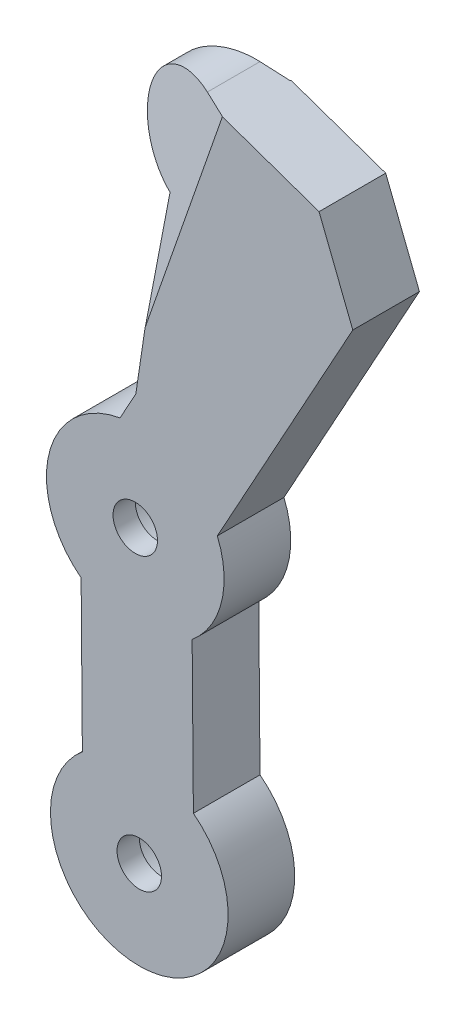
ISO-10303-21;
HEADER;
FILE_DESCRIPTION(('STEP AP214'),'2;1');
FILE_NAME('part.step','',(''),(''),'','','');
FILE_SCHEMA(('AUTOMOTIVE_DESIGN { 1 0 10303 214 1 1 1 1 }'));
ENDSEC;
DATA;
#1=APPLICATION_CONTEXT('core data for automotive mechanical design processes');
#2=APPLICATION_PROTOCOL_DEFINITION('international standard','automotive_design',2000,#1);
#3=PRODUCT_CONTEXT('',#1,'mechanical');
#4=PRODUCT('Part','Part','',(#3));
#5=PRODUCT_RELATED_PRODUCT_CATEGORY('part','',(#4));
#6=PRODUCT_DEFINITION_FORMATION('','',#4);
#7=PRODUCT_DEFINITION_CONTEXT('part definition',#1,'design');
#8=PRODUCT_DEFINITION('design','',#6,#7);
#9=PRODUCT_DEFINITION_SHAPE('','',#8);
#10=(LENGTH_UNIT() NAMED_UNIT(*) SI_UNIT(.MILLI.,.METRE.));
#11=(NAMED_UNIT(*) PLANE_ANGLE_UNIT() SI_UNIT($,.RADIAN.));
#12=(NAMED_UNIT(*) SI_UNIT($,.STERADIAN.) SOLID_ANGLE_UNIT());
#13=UNCERTAINTY_MEASURE_WITH_UNIT(LENGTH_MEASURE(1.E-05),#10,'distance_accuracy_value','');
#14=(GEOMETRIC_REPRESENTATION_CONTEXT(3) GLOBAL_UNCERTAINTY_ASSIGNED_CONTEXT((#13)) GLOBAL_UNIT_ASSIGNED_CONTEXT((#10,
#11,#12)) REPRESENTATION_CONTEXT('',''));
#15=CARTESIAN_POINT('',(0.,0.,0.));
#16=DIRECTION('',(0.,0.,1.));
#17=DIRECTION('',(1.,0.,0.));
#18=AXIS2_PLACEMENT_3D('',#15,#16,#17);
#19=CARTESIAN_POINT('',(40.5387405240072,99.7887515998659,15.));
#20=DIRECTION('',(-0.329855903742735,-0.944031293319275,0.));
#21=DIRECTION('',(0.944031293319275,-0.329855903742735,0.));
#22=AXIS2_PLACEMENT_3D('',#19,#20,#21);
#23=PLANE('',#22);
#24=DIRECTION('',(0.909794514596686,-0.317893160911327,0.26686678222586));
#25=VECTOR('',#24,1.);
#26=CARTESIAN_POINT('',(1.4985019433755,113.42988115826,9.90270766438961));
#27=LINE('',#26,#25);
#28=CARTESIAN_POINT('',(13.9405368470513,109.082484311784,13.5522854160841));
#29=VERTEX_POINT('',#28);
#30=CARTESIAN_POINT('',(18.7796984945253,107.39162294958,14.9717394541256));
#31=VERTEX_POINT('',#30);
#32=EDGE_CURVE('E178',#29,#31,#27,.T.);
#33=ORIENTED_EDGE('',*,*,#32,.T.);
#34=DIRECTION('',(-0.251930593568632,0.0880275836300266,0.963733428155533));
#35=VECTOR('',#34,1.);
#36=CARTESIAN_POINT('',(18.7796984945253,107.39162294958,14.9717394541256));
#37=LINE('',#36,#35);
#38=CARTESIAN_POINT('',(18.7723108747866,107.394204272893,15.));
#39=VERTEX_POINT('',#38);
#40=EDGE_CURVE('E183',#31,#39,#37,.T.);
#41=ORIENTED_EDGE('',*,*,#40,.T.);
#42=DIRECTION('',(-0.944031293319275,0.329855903742735,0.));
#43=VECTOR('',#42,1.);
#44=CARTESIAN_POINT('',(40.5387405240072,99.7887515998659,15.));
#45=LINE('',#44,#43);
#46=CARTESIAN_POINT('',(40.5387405240072,99.7887515998659,15.));
#47=VERTEX_POINT('',#46);
#48=EDGE_CURVE('E239',#47,#39,#45,.T.);
#49=ORIENTED_EDGE('',*,*,#48,.F.);
#50=DIRECTION('',(0.,0.,-1.));
#51=VECTOR('',#50,1.);
#52=CARTESIAN_POINT('',(40.5387405240072,99.7887515998659,15.));
#53=LINE('',#52,#51);
#54=CARTESIAN_POINT('',(40.5387405240072,99.7887515998659,0.));
#55=VERTEX_POINT('',#54);
#56=EDGE_CURVE('E307',#47,#55,#53,.T.);
#57=ORIENTED_EDGE('',*,*,#56,.T.);
#58=DIRECTION('',(-0.944031293319275,0.329855903742735,0.));
#59=VECTOR('',#58,1.);
#60=CARTESIAN_POINT('',(40.5387405240072,99.7887515998659,0.));
#61=LINE('',#60,#59);
#62=CARTESIAN_POINT('',(19.2282017215764,107.234910520302,0.));
#63=VERTEX_POINT('',#62);
#64=EDGE_CURVE('E261',#55,#63,#61,.T.);
#65=ORIENTED_EDGE('',*,*,#64,.T.);
#66=DIRECTION('',(0.249047617057943,-0.0870202369147936,0.964573876281674));
#67=VECTOR('',#66,1.);
#68=CARTESIAN_POINT('',(16.7779917016719,108.091043411441,-9.48978594745467));
#69=LINE('',#68,#67);
#70=CARTESIAN_POINT('',(19.2684678722513,107.220841042293,0.15595281536207));
#71=VERTEX_POINT('',#70);
#72=EDGE_CURVE('E86',#63,#71,#69,.T.);
#73=ORIENTED_EDGE('',*,*,#72,.T.);
#74=DIRECTION('',(-0.910587923928175,0.318170387687524,0.26381288292073));
#75=VECTOR('',#74,1.);
#76=CARTESIAN_POINT('',(19.2684678722513,107.220841042293,0.15595281536207));
#77=LINE('',#76,#75);
#78=CARTESIAN_POINT('',(13.9405368470513,109.082484311784,1.69954548425813));
#79=VERTEX_POINT('',#78);
#80=EDGE_CURVE('E198',#71,#79,#77,.T.);
#81=ORIENTED_EDGE('',*,*,#80,.T.);
#82=DIRECTION('',(0.,0.,-1.));
#83=VECTOR('',#82,1.);
#84=CARTESIAN_POINT('',(13.9405368470313,109.082484311791,15.));
#85=LINE('',#84,#83);
#86=EDGE_CURVE('E190',#29,#79,#85,.T.);
#87=ORIENTED_EDGE('',*,*,#86,.F.);
#88=EDGE_LOOP('',(#33,#41,#49,#57,#65,#73,#81,#87));
#89=FACE_BOUND('',#88,.T.);
#90=ADVANCED_FACE('F63',(#89),#23,.F.);
#91=CARTESIAN_POINT('',(9.84138893483781,97.1588665920305,15.));
#92=DIRECTION('',(0.,0.,-1.));
#93=DIRECTION('',(-1.,0.,0.));
#94=AXIS2_PLACEMENT_3D('',#91,#92,#93);
#95=CYLINDRICAL_SURFACE('',#94,12.6085555529975);
#96=CARTESIAN_POINT('',(9.84138893483781,97.1588665920305,13.5698281191331));
#97=DIRECTION('',(-0.251930593568632,0.0880275836300267,0.963733428155533));
#98=DIRECTION('',(-0.909794514596687,0.317893160911327,-0.26686678222586));
#99=AXIS2_PLACEMENT_3D('',#96,#97,#98);
#100=ELLIPSE('',#99,13.0830322832412,12.6085555529975);
#101=CARTESIAN_POINT('',(5.30776865440435,85.3935803530193,13.4593329066422));
#102=VERTEX_POINT('',#101);
#103=EDGE_CURVE('E196',#29,#102,#100,.T.);
#104=ORIENTED_EDGE('',*,*,#103,.F.);
#105=ORIENTED_EDGE('',*,*,#86,.T.);
#106=CARTESIAN_POINT('',(9.84138893483781,97.1588665920305,1.68221864205295));
#107=DIRECTION('',(-0.249047617057943,0.0870202369147936,-0.964573876281674));
#108=DIRECTION('',(0.910587923928175,-0.318170387687524,-0.26381288292073));
#109=AXIS2_PLACEMENT_3D('',#106,#107,#108);
#110=ELLIPSE('',#109,13.0716328350112,12.6085555529975);
#111=CARTESIAN_POINT('',(5.30776865440435,85.3935803530193,1.79135422428974));
#112=VERTEX_POINT('',#111);
#113=EDGE_CURVE('E208',#112,#79,#110,.T.);
#114=ORIENTED_EDGE('',*,*,#113,.F.);
#115=DIRECTION('',(0.,0.,-1.));
#116=VECTOR('',#115,1.);
#117=CARTESIAN_POINT('',(5.30776865440435,85.3935803530193,15.));
#118=LINE('',#117,#116);
#119=EDGE_CURVE('E304',#102,#112,#118,.T.);
#120=ORIENTED_EDGE('',*,*,#119,.F.);
#121=EDGE_LOOP('',(#104,#105,#114,#120));
#122=FACE_BOUND('',#121,.T.);
#123=ADVANCED_FACE('F377',(#122),#95,.T.);
#124=CARTESIAN_POINT('',(5.50581694547402,85.3260122167898,15.));
#125=DIRECTION('',(0.322895145350239,0.946434744242437,0.));
#126=DIRECTION('',(-0.946434744242438,0.322895145350239,0.));
#127=AXIS2_PLACEMENT_3D('',#124,#125,#126);
#128=PLANE('',#127);
#129=DIRECTION('',(0.912112561886724,-0.311185446263318,0.266860061609707));
#130=VECTOR('',#129,1.);
#131=CARTESIAN_POINT('',(5.866721329619,85.2028824666565,13.6228677065973));
#132=LINE('',#131,#130);
#133=CARTESIAN_POINT('',(5.50581694547402,85.3260122167898,13.5172766093879));
#134=VERTEX_POINT('',#133);
#135=EDGE_CURVE('E194',#102,#134,#132,.T.);
#136=ORIENTED_EDGE('',*,*,#135,.F.);
#137=ORIENTED_EDGE('',*,*,#119,.T.);
#138=DIRECTION('',(-0.912907952614777,0.311456809721081,0.263806227619939));
#139=VECTOR('',#138,1.);
#140=CARTESIAN_POINT('',(2.3109852564209,86.4159929564889,2.65734528171421));
#141=LINE('',#140,#139);
#142=CARTESIAN_POINT('',(5.50581694547402,85.3260122167898,1.73412351181318));
#143=VERTEX_POINT('',#142);
#144=EDGE_CURVE('E205',#143,#112,#141,.T.);
#145=ORIENTED_EDGE('',*,*,#144,.F.);
#146=DIRECTION('',(0.,0.,-1.));
#147=VECTOR('',#146,1.);
#148=CARTESIAN_POINT('',(5.50581694547402,85.3260122167898,15.));
#149=LINE('',#148,#147);
#150=EDGE_CURVE('E302',#134,#143,#149,.T.);
#151=ORIENTED_EDGE('',*,*,#150,.F.);
#152=EDGE_LOOP('',(#136,#137,#145,#151));
#153=FACE_BOUND('',#152,.T.);
#154=ADVANCED_FACE('F374',(#153),#128,.F.);
#155=CARTESIAN_POINT('',(5.50581694547402,85.3260122167898,15.));
#156=DIRECTION('',(0.989057231211688,-0.147532346920497,0.));
#157=DIRECTION('',(0.147532346920497,0.989057231211688,0.));
#158=AXIS2_PLACEMENT_3D('',#155,#156,#157);
#159=PLANE('',#158);
#160=DIRECTION('',(-0.147335009292332,-0.987734279247586,0.0517048221743451));
#161=VECTOR('',#160,1.);
#162=CARTESIAN_POINT('',(5.49452166179957,85.2502886061376,13.5212405052508));
#163=LINE('',#162,#161);
#164=CARTESIAN_POINT('',(1.36126547555131,57.5409285587288,14.9717394541256));
#165=VERTEX_POINT('',#164);
#166=EDGE_CURVE('E12',#134,#165,#163,.T.);
#167=ORIENTED_EDGE('',*,*,#166,.F.);
#168=ORIENTED_EDGE('',*,*,#150,.T.);
#169=DIRECTION('',(0.147339826401463,0.987766573159521,0.0510702702624874));
#170=VECTOR('',#169,1.);
#171=CARTESIAN_POINT('',(5.60563848404308,85.9952160667469,1.76872320612019));
#172=LINE('',#171,#170);
#173=CARTESIAN_POINT('',(0.952729694283552,54.8021036358845,0.155952815362067));
#174=VERTEX_POINT('',#173);
#175=EDGE_CURVE('E312',#174,#143,#172,.T.);
#176=ORIENTED_EDGE('',*,*,#175,.F.);
#177=DIRECTION('',(-0.121793071676651,-0.81650106412385,0.564351362163844));
#178=VECTOR('',#177,1.);
#179=CARTESIAN_POINT('',(3.0354009720215,68.7643372102858,-9.49450066569776));
#180=LINE('',#179,#178);
#181=CARTESIAN_POINT('',(0.986385983065761,55.0277354819887,0.));
#182=VERTEX_POINT('',#181);
#183=EDGE_CURVE('E203',#182,#174,#180,.T.);
#184=ORIENTED_EDGE('',*,*,#183,.F.);
#185=DIRECTION('',(-0.147532346920497,-0.989057231211688,0.));
#186=VECTOR('',#185,1.);
#187=CARTESIAN_POINT('',(5.50581694547402,85.3260122167898,0.));
#188=LINE('',#187,#186);
#189=CARTESIAN_POINT('',(-0.715580359542123,43.6177487667205,0.));
#190=VERTEX_POINT('',#189);
#191=EDGE_CURVE('E264',#182,#190,#188,.T.);
#192=ORIENTED_EDGE('',*,*,#191,.T.);
#193=DIRECTION('',(0.,0.,-1.));
#194=VECTOR('',#193,1.);
#195=CARTESIAN_POINT('',(-0.715580359542123,43.6177487667205,15.));
#196=LINE('',#195,#194);
#197=CARTESIAN_POINT('',(-0.715580359542123,43.6177487667205,15.));
#198=VERTEX_POINT('',#197);
#199=EDGE_CURVE('E299',#198,#190,#196,.T.);
#200=ORIENTED_EDGE('',*,*,#199,.F.);
#201=DIRECTION('',(-0.147532346920497,-0.989057231211688,0.));
#202=VECTOR('',#201,1.);
#203=CARTESIAN_POINT('',(5.50581694547402,85.3260122167898,15.));
#204=LINE('',#203,#202);
#205=CARTESIAN_POINT('',(1.36744038572204,57.5823251723118,15.));
#206=VERTEX_POINT('',#205);
#207=EDGE_CURVE('E242',#206,#198,#204,.T.);
#208=ORIENTED_EDGE('',*,*,#207,.F.);
#209=DIRECTION('',(0.122270233047621,0.819699955175634,0.55959089842093));
#210=VECTOR('',#209,1.);
#211=CARTESIAN_POINT('',(4.20991754207175,76.6382993008648,28.0090890155022));
#212=LINE('',#211,#210);
#213=EDGE_CURVE('E78',#165,#206,#212,.T.);
#214=ORIENTED_EDGE('',*,*,#213,.F.);
#215=EDGE_LOOP('',(#167,#168,#176,#184,#192,#200,#208,#214));
#216=FACE_BOUND('',#215,.T.);
#217=ADVANCED_FACE('F319',(#216),#159,.F.);
#218=CARTESIAN_POINT('',(-0.839707243672549,17.4582706729418,15.));
#219=DIRECTION('',(0.,0.,1.));
#220=DIRECTION('',(1.,0.,0.));
#221=AXIS2_PLACEMENT_3D('',#218,#219,#220);
#222=PLANE('',#221);
#223=CARTESIAN_POINT('',(-0.839707243672549,17.4582706729418,15.));
#224=DIRECTION('',(0.,0.,1.));
#225=DIRECTION('',(1.,0.,0.));
#226=AXIS2_PLACEMENT_3D('',#223,#224,#225);
#227=CIRCLE('',#226,5.);
#228=CARTESIAN_POINT('',(4.16029275632745,17.4582706729418,15.));
#229=VERTEX_POINT('',#228);
#230=EDGE_CURVE('E220',#229,#229,#227,.T.);
#231=ORIENTED_EDGE('',*,*,#230,.F.);
#232=EDGE_LOOP('',(#231));
#233=FACE_BOUND('',#232,.T.);
#234=CARTESIAN_POINT('',(0.0627733290771948,-47.5417293270582,15.));
#235=DIRECTION('',(0.,0.,1.));
#236=DIRECTION('',(1.,0.,0.));
#237=AXIS2_PLACEMENT_3D('',#234,#235,#236);
#238=CIRCLE('',#237,5.);
#239=CARTESIAN_POINT('',(5.06277332907719,-47.5417293270582,15.));
#240=VERTEX_POINT('',#239);
#241=EDGE_CURVE('E214',#240,#240,#238,.T.);
#242=ORIENTED_EDGE('',*,*,#241,.F.);
#243=EDGE_LOOP('',(#242));
#244=FACE_BOUND('',#243,.T.);
#245=ORIENTED_EDGE('',*,*,#48,.T.);
#246=DIRECTION('',(-0.329855903742735,-0.944031293319275,0.));
#247=VECTOR('',#246,1.);
#248=CARTESIAN_POINT('',(-11.3671098096123,21.1366719208941,15.));
#249=LINE('',#248,#247);
#250=EDGE_CURVE('E71',#39,#206,#249,.T.);
#251=ORIENTED_EDGE('',*,*,#250,.T.);
#252=ORIENTED_EDGE('',*,*,#207,.T.);
#253=DIRECTION('',(-0.48233631116927,-0.87598612028252,0.));
#254=VECTOR('',#253,1.);
#255=CARTESIAN_POINT('',(-4.27033710901568,37.1618434131079,15.));
#256=LINE('',#255,#254);
#257=CARTESIAN_POINT('',(-4.27033710901568,37.1618434131079,15.));
#258=VERTEX_POINT('',#257);
#259=EDGE_CURVE('E244',#198,#258,#256,.T.);
#260=ORIENTED_EDGE('',*,*,#259,.T.);
#261=CARTESIAN_POINT('',(-0.839707243672549,17.4582706729418,15.));
#262=DIRECTION('',(0.,0.,1.));
#263=DIRECTION('',(1.,0.,0.));
#264=AXIS2_PLACEMENT_3D('',#261,#262,#263);
#265=CIRCLE('',#264,20.);
#266=CARTESIAN_POINT('',(-13.0309125696976,1.60347604485851,15.));
#267=VERTEX_POINT('',#266);
#268=EDGE_CURVE('E246',#258,#267,#265,.T.);
#269=ORIENTED_EDGE('',*,*,#268,.T.);
#270=DIRECTION('',(0.00827665513011626,-0.999965747903325,0.));
#271=VECTOR('',#270,1.);
#272=CARTESIAN_POINT('',(-13.0309125696976,1.60347604485851,15.));
#273=LINE('',#272,#271);
#274=CARTESIAN_POINT('',(-12.7512398622865,-32.1859139487867,15.));
#275=VERTEX_POINT('',#274);
#276=EDGE_CURVE('E248',#267,#275,#273,.T.);
#277=ORIENTED_EDGE('',*,*,#276,.T.);
#278=CARTESIAN_POINT('',(0.0627733290771949,-47.5417293270582,15.));
#279=DIRECTION('',(0.,0.,1.));
#280=DIRECTION('',(1.,0.,0.));
#281=AXIS2_PLACEMENT_3D('',#278,#279,#280);
#282=CIRCLE('',#281,20.0000000000001);
#283=CARTESIAN_POINT('',(12.2436198655101,-31.6789749112619,15.));
#284=VERTEX_POINT('',#283);
#285=EDGE_CURVE('E250',#275,#284,#282,.T.);
#286=ORIENTED_EDGE('',*,*,#285,.T.);
#287=DIRECTION('',(-0.00827085395216305,0.999965795902491,0.));
#288=VECTOR('',#287,1.);
#289=CARTESIAN_POINT('',(11.9642781989979,2.09409296035713,15.));
#290=LINE('',#289,#288);
#291=CARTESIAN_POINT('',(11.9642781989979,2.09409296035712,15.));
#292=VERTEX_POINT('',#291);
#293=EDGE_CURVE('E252',#284,#292,#290,.T.);
#294=ORIENTED_EDGE('',*,*,#293,.T.);
#295=CARTESIAN_POINT('',(-0.839707243672549,17.4582706729418,15.));
#296=DIRECTION('',(0.,0.,1.));
#297=DIRECTION('',(1.,0.,0.));
#298=AXIS2_PLACEMENT_3D('',#295,#296,#297);
#299=CIRCLE('',#298,20.);
#300=CARTESIAN_POINT('',(17.6362151559132,25.1159655927259,15.));
#301=VERTEX_POINT('',#300);
#302=EDGE_CURVE('E254',#292,#301,#299,.T.);
#303=ORIENTED_EDGE('',*,*,#302,.T.);
#304=DIRECTION('',(0.482336311169269,0.87598612028252,0.));
#305=VECTOR('',#304,1.);
#306=CARTESIAN_POINT('',(17.6362151559132,25.1159655927259,15.));
#307=LINE('',#306,#305);
#308=CARTESIAN_POINT('',(48.1292087035366,80.4952486677015,15.));
#309=VERTEX_POINT('',#308);
#310=EDGE_CURVE('E256',#301,#309,#307,.T.);
#311=ORIENTED_EDGE('',*,*,#310,.T.);
#312=DIRECTION('',(-0.36610684099222,0.930572824113566,0.));
#313=VECTOR('',#312,1.);
#314=CARTESIAN_POINT('',(40.5387405240072,99.7887515998659,15.));
#315=LINE('',#314,#313);
#316=EDGE_CURVE('E236',#309,#47,#315,.T.);
#317=ORIENTED_EDGE('',*,*,#316,.T.);
#318=EDGE_LOOP('',(#245,#251,#252,#260,#269,#277,#286,#294,#303,#311,#317));
#319=FACE_BOUND('',#318,.T.);
#320=ADVANCED_FACE('F316',(#233,#244,#319),#222,.T.);
#321=CARTESIAN_POINT('',(-0.839707243672549,17.4582706729418,0.));
#322=DIRECTION('',(0.,0.,1.));
#323=DIRECTION('',(1.,0.,0.));
#324=AXIS2_PLACEMENT_3D('',#321,#322,#323);
#325=PLANE('',#324);
#326=CARTESIAN_POINT('',(-0.839707243672549,17.4582706729418,0.));
#327=DIRECTION('',(0.,0.,-1.));
#328=DIRECTION('',(-1.,0.,0.));
#329=AXIS2_PLACEMENT_3D('',#326,#327,#328);
#330=CIRCLE('',#329,11.1);
#331=CARTESIAN_POINT('',(-11.9397072436725,17.4582706729418,0.));
#332=VERTEX_POINT('',#331);
#333=EDGE_CURVE('E227',#332,#332,#330,.T.);
#334=ORIENTED_EDGE('',*,*,#333,.F.);
#335=EDGE_LOOP('',(#334));
#336=FACE_BOUND('',#335,.T.);
#337=CARTESIAN_POINT('',(0.0627733290771949,-47.5417293270582,0.));
#338=DIRECTION('',(0.,0.,-1.));
#339=DIRECTION('',(-1.,0.,0.));
#340=AXIS2_PLACEMENT_3D('',#337,#338,#339);
#341=CIRCLE('',#340,11.1);
#342=CARTESIAN_POINT('',(-11.0372266709228,-47.5417293270582,0.));
#343=VERTEX_POINT('',#342);
#344=EDGE_CURVE('E223',#343,#343,#341,.T.);
#345=ORIENTED_EDGE('',*,*,#344,.F.);
#346=EDGE_LOOP('',(#345));
#347=FACE_BOUND('',#346,.T.);
#348=DIRECTION('',(-0.329855903742735,-0.944031293319275,0.));
#349=VECTOR('',#348,1.);
#350=CARTESIAN_POINT('',(-10.9112189628225,20.9773781683034,0.));
#351=LINE('',#350,#349);
#352=EDGE_CURVE('E310',#63,#182,#351,.T.);
#353=ORIENTED_EDGE('',*,*,#352,.F.);
#354=ORIENTED_EDGE('',*,*,#64,.F.);
#355=DIRECTION('',(-0.36610684099222,0.930572824113566,0.));
#356=VECTOR('',#355,1.);
#357=CARTESIAN_POINT('',(40.5387405240072,99.7887515998659,0.));
#358=LINE('',#357,#356);
#359=CARTESIAN_POINT('',(48.1292087035366,80.4952486677015,0.));
#360=VERTEX_POINT('',#359);
#361=EDGE_CURVE('E233',#360,#55,#358,.T.);
#362=ORIENTED_EDGE('',*,*,#361,.F.);
#363=DIRECTION('',(0.482336311169269,0.87598612028252,0.));
#364=VECTOR('',#363,1.);
#365=CARTESIAN_POINT('',(17.6362151559132,25.1159655927259,0.));
#366=LINE('',#365,#364);
#367=CARTESIAN_POINT('',(17.6362151559132,25.1159655927259,0.));
#368=VERTEX_POINT('',#367);
#369=EDGE_CURVE('E240',#368,#360,#366,.T.);
#370=ORIENTED_EDGE('',*,*,#369,.F.);
#371=CARTESIAN_POINT('',(-0.839707243672549,17.4582706729418,0.));
#372=DIRECTION('',(0.,0.,1.));
#373=DIRECTION('',(1.,0.,0.));
#374=AXIS2_PLACEMENT_3D('',#371,#372,#373);
#375=CIRCLE('',#374,20.);
#376=CARTESIAN_POINT('',(11.9642781989979,2.09409296035712,0.));
#377=VERTEX_POINT('',#376);
#378=EDGE_CURVE('E276',#377,#368,#375,.T.);
#379=ORIENTED_EDGE('',*,*,#378,.F.);
#380=DIRECTION('',(-0.00827085395216305,0.999965795902491,0.));
#381=VECTOR('',#380,1.);
#382=CARTESIAN_POINT('',(11.9642781989979,2.09409296035713,0.));
#383=LINE('',#382,#381);
#384=CARTESIAN_POINT('',(12.2436198655101,-31.6789749112619,0.));
#385=VERTEX_POINT('',#384);
#386=EDGE_CURVE('E274',#385,#377,#383,.T.);
#387=ORIENTED_EDGE('',*,*,#386,.F.);
#388=CARTESIAN_POINT('',(0.0627733290771949,-47.5417293270582,0.));
#389=DIRECTION('',(0.,0.,1.));
#390=DIRECTION('',(1.,0.,0.));
#391=AXIS2_PLACEMENT_3D('',#388,#389,#390);
#392=CIRCLE('',#391,20.0000000000001);
#393=CARTESIAN_POINT('',(-12.7512398622865,-32.1859139487867,0.));
#394=VERTEX_POINT('',#393);
#395=EDGE_CURVE('E272',#394,#385,#392,.T.);
#396=ORIENTED_EDGE('',*,*,#395,.F.);
#397=DIRECTION('',(0.00827665513011626,-0.999965747903325,0.));
#398=VECTOR('',#397,1.);
#399=CARTESIAN_POINT('',(-13.0309125696976,1.60347604485851,0.));
#400=LINE('',#399,#398);
#401=CARTESIAN_POINT('',(-13.0309125696976,1.60347604485851,0.));
#402=VERTEX_POINT('',#401);
#403=EDGE_CURVE('E270',#402,#394,#400,.T.);
#404=ORIENTED_EDGE('',*,*,#403,.F.);
#405=CARTESIAN_POINT('',(-0.839707243672549,17.4582706729418,0.));
#406=DIRECTION('',(0.,0.,1.));
#407=DIRECTION('',(1.,0.,0.));
#408=AXIS2_PLACEMENT_3D('',#405,#406,#407);
#409=CIRCLE('',#408,20.);
#410=CARTESIAN_POINT('',(-4.27033710901568,37.1618434131079,0.));
#411=VERTEX_POINT('',#410);
#412=EDGE_CURVE('E268',#411,#402,#409,.T.);
#413=ORIENTED_EDGE('',*,*,#412,.F.);
#414=DIRECTION('',(-0.48233631116927,-0.87598612028252,0.));
#415=VECTOR('',#414,1.);
#416=CARTESIAN_POINT('',(-4.27033710901568,37.1618434131079,0.));
#417=LINE('',#416,#415);
#418=EDGE_CURVE('E266',#190,#411,#417,.T.);
#419=ORIENTED_EDGE('',*,*,#418,.F.);
#420=ORIENTED_EDGE('',*,*,#191,.F.);
#421=EDGE_LOOP('',(#353,#354,#362,#370,#379,#387,#396,#404,#413,#419,#420));
#422=FACE_BOUND('',#421,.T.);
#423=ADVANCED_FACE('F362',(#336,#347,#422),#325,.F.);
#424=CARTESIAN_POINT('',(40.5387405240072,99.7887515998659,15.));
#425=DIRECTION('',(-0.930572824113566,-0.36610684099222,0.));
#426=DIRECTION('',(0.36610684099222,-0.930572824113566,0.));
#427=AXIS2_PLACEMENT_3D('',#424,#425,#426);
#428=PLANE('',#427);
#429=ORIENTED_EDGE('',*,*,#361,.T.);
#430=ORIENTED_EDGE('',*,*,#56,.F.);
#431=ORIENTED_EDGE('',*,*,#316,.F.);
#432=DIRECTION('',(0.,0.,-1.));
#433=VECTOR('',#432,1.);
#434=CARTESIAN_POINT('',(48.1292087035366,80.4952486677015,15.));
#435=LINE('',#434,#433);
#436=EDGE_CURVE('E258',#309,#360,#435,.T.);
#437=ORIENTED_EDGE('',*,*,#436,.T.);
#438=EDGE_LOOP('',(#429,#430,#431,#437));
#439=FACE_BOUND('',#438,.T.);
#440=ADVANCED_FACE('F65',(#439),#428,.F.);
#441=CARTESIAN_POINT('',(-4.27033710901568,37.1618434131079,15.));
#442=DIRECTION('',(0.87598612028252,-0.48233631116927,0.));
#443=DIRECTION('',(0.48233631116927,0.87598612028252,0.));
#444=AXIS2_PLACEMENT_3D('',#441,#442,#443);
#445=PLANE('',#444);
#446=ORIENTED_EDGE('',*,*,#418,.T.);
#447=DIRECTION('',(0.,0.,-1.));
#448=VECTOR('',#447,1.);
#449=CARTESIAN_POINT('',(-4.27033710901568,37.1618434131079,15.));
#450=LINE('',#449,#448);
#451=EDGE_CURVE('E296',#258,#411,#450,.T.);
#452=ORIENTED_EDGE('',*,*,#451,.F.);
#453=ORIENTED_EDGE('',*,*,#259,.F.);
#454=ORIENTED_EDGE('',*,*,#199,.T.);
#455=EDGE_LOOP('',(#446,#452,#453,#454));
#456=FACE_BOUND('',#455,.T.);
#457=ADVANCED_FACE('F326',(#456),#445,.F.);
#458=CARTESIAN_POINT('',(-0.839707243672549,17.4582706729418,15.));
#459=DIRECTION('',(0.,0.,-1.));
#460=DIRECTION('',(-1.,0.,0.));
#461=AXIS2_PLACEMENT_3D('',#458,#459,#460);
#462=CYLINDRICAL_SURFACE('',#461,20.);
#463=ORIENTED_EDGE('',*,*,#412,.T.);
#464=DIRECTION('',(0.,0.,-1.));
#465=VECTOR('',#464,1.);
#466=CARTESIAN_POINT('',(-13.0309125696976,1.60347604485851,15.));
#467=LINE('',#466,#465);
#468=EDGE_CURVE('E293',#267,#402,#467,.T.);
#469=ORIENTED_EDGE('',*,*,#468,.F.);
#470=ORIENTED_EDGE('',*,*,#268,.F.);
#471=ORIENTED_EDGE('',*,*,#451,.T.);
#472=EDGE_LOOP('',(#463,#469,#470,#471));
#473=FACE_BOUND('',#472,.T.);
#474=ADVANCED_FACE('F332',(#473),#462,.T.);
#475=CARTESIAN_POINT('',(-13.0309125696976,1.60347604485851,15.));
#476=DIRECTION('',(0.999965747903326,0.00827665513011626,0.));
#477=DIRECTION('',(-0.00827665513011626,0.999965747903326,0.));
#478=AXIS2_PLACEMENT_3D('',#475,#476,#477);
#479=PLANE('',#478);
#480=ORIENTED_EDGE('',*,*,#403,.T.);
#481=DIRECTION('',(0.,0.,-1.));
#482=VECTOR('',#481,1.);
#483=CARTESIAN_POINT('',(-12.7512398622865,-32.1859139487867,15.));
#484=LINE('',#483,#482);
#485=EDGE_CURVE('E290',#275,#394,#484,.T.);
#486=ORIENTED_EDGE('',*,*,#485,.F.);
#487=ORIENTED_EDGE('',*,*,#276,.F.);
#488=ORIENTED_EDGE('',*,*,#468,.T.);
#489=EDGE_LOOP('',(#480,#486,#487,#488));
#490=FACE_BOUND('',#489,.T.);
#491=ADVANCED_FACE('F336',(#490),#479,.F.);
#492=CARTESIAN_POINT('',(0.0627733290771949,-47.5417293270582,15.));
#493=DIRECTION('',(0.,0.,-1.));
#494=DIRECTION('',(-1.,0.,0.));
#495=AXIS2_PLACEMENT_3D('',#492,#493,#494);
#496=CYLINDRICAL_SURFACE('',#495,20.0000000000001);
#497=ORIENTED_EDGE('',*,*,#395,.T.);
#498=DIRECTION('',(0.,0.,-1.));
#499=VECTOR('',#498,1.);
#500=CARTESIAN_POINT('',(12.2436198655101,-31.6789749112619,15.));
#501=LINE('',#500,#499);
#502=EDGE_CURVE('E287',#284,#385,#501,.T.);
#503=ORIENTED_EDGE('',*,*,#502,.F.);
#504=ORIENTED_EDGE('',*,*,#285,.F.);
#505=ORIENTED_EDGE('',*,*,#485,.T.);
#506=EDGE_LOOP('',(#497,#503,#504,#505));
#507=FACE_BOUND('',#506,.T.);
#508=ADVANCED_FACE('F341',(#507),#496,.T.);
#509=CARTESIAN_POINT('',(11.9642781989979,2.09409296035713,15.));
#510=DIRECTION('',(-0.999965795902491,-0.00827085395216305,0.));
#511=DIRECTION('',(0.00827085395216305,-0.999965795902491,0.));
#512=AXIS2_PLACEMENT_3D('',#509,#510,#511);
#513=PLANE('',#512);
#514=ORIENTED_EDGE('',*,*,#386,.T.);
#515=DIRECTION('',(0.,0.,-1.));
#516=VECTOR('',#515,1.);
#517=CARTESIAN_POINT('',(11.9642781989979,2.09409296035712,15.));
#518=LINE('',#517,#516);
#519=EDGE_CURVE('E284',#292,#377,#518,.T.);
#520=ORIENTED_EDGE('',*,*,#519,.F.);
#521=ORIENTED_EDGE('',*,*,#293,.F.);
#522=ORIENTED_EDGE('',*,*,#502,.T.);
#523=EDGE_LOOP('',(#514,#520,#521,#522));
#524=FACE_BOUND('',#523,.T.);
#525=ADVANCED_FACE('F347',(#524),#513,.F.);
#526=CARTESIAN_POINT('',(-0.839707243672549,17.4582706729418,15.));
#527=DIRECTION('',(0.,0.,-1.));
#528=DIRECTION('',(-1.,0.,0.));
#529=AXIS2_PLACEMENT_3D('',#526,#527,#528);
#530=CYLINDRICAL_SURFACE('',#529,20.);
#531=ORIENTED_EDGE('',*,*,#378,.T.);
#532=DIRECTION('',(0.,0.,-1.));
#533=VECTOR('',#532,1.);
#534=CARTESIAN_POINT('',(17.6362151559132,25.1159655927259,15.));
#535=LINE('',#534,#533);
#536=EDGE_CURVE('E281',#301,#368,#535,.T.);
#537=ORIENTED_EDGE('',*,*,#536,.F.);
#538=ORIENTED_EDGE('',*,*,#302,.F.);
#539=ORIENTED_EDGE('',*,*,#519,.T.);
#540=EDGE_LOOP('',(#531,#537,#538,#539));
#541=FACE_BOUND('',#540,.T.);
#542=ADVANCED_FACE('F351',(#541),#530,.T.);
#543=CARTESIAN_POINT('',(17.6362151559132,25.1159655927259,15.));
#544=DIRECTION('',(-0.87598612028252,0.482336311169269,0.));
#545=DIRECTION('',(-0.482336311169269,-0.87598612028252,0.));
#546=AXIS2_PLACEMENT_3D('',#543,#544,#545);
#547=PLANE('',#546);
#548=ORIENTED_EDGE('',*,*,#369,.T.);
#549=ORIENTED_EDGE('',*,*,#436,.F.);
#550=ORIENTED_EDGE('',*,*,#310,.F.);
#551=ORIENTED_EDGE('',*,*,#536,.T.);
#552=EDGE_LOOP('',(#548,#549,#550,#551));
#553=FACE_BOUND('',#552,.T.);
#554=ADVANCED_FACE('F356',(#553),#547,.F.);
#555=CARTESIAN_POINT('',(-0.839707243672549,17.4582706729418,10.));
#556=DIRECTION('',(0.,0.,-1.));
#557=DIRECTION('',(-1.,0.,0.));
#558=AXIS2_PLACEMENT_3D('',#555,#556,#557);
#559=CYLINDRICAL_SURFACE('',#558,11.1);
#560=CARTESIAN_POINT('',(-0.839707243672549,17.4582706729418,10.));
#561=DIRECTION('',(0.,0.,-1.));
#562=DIRECTION('',(-1.,0.,0.));
#563=AXIS2_PLACEMENT_3D('',#560,#561,#562);
#564=CIRCLE('',#563,11.1);
#565=CARTESIAN_POINT('',(-11.9397072436725,17.4582706729418,10.));
#566=VERTEX_POINT('',#565);
#567=EDGE_CURVE('E230',#566,#566,#564,.T.);
#568=ORIENTED_EDGE('',*,*,#567,.F.);
#569=EDGE_LOOP('',(#568));
#570=FACE_BOUND('',#569,.T.);
#571=ORIENTED_EDGE('',*,*,#333,.T.);
#572=EDGE_LOOP('',(#571));
#573=FACE_BOUND('',#572,.T.);
#574=ADVANCED_FACE('F402',(#570,#573),#559,.F.);
#575=CARTESIAN_POINT('',(-0.839707243672549,17.4582706729418,10.));
#576=DIRECTION('',(0.,0.,-1.));
#577=DIRECTION('',(-1.,0.,0.));
#578=AXIS2_PLACEMENT_3D('',#575,#576,#577);
#579=PLANE('',#578);
#580=CARTESIAN_POINT('',(-0.839707243672549,17.4582706729418,10.));
#581=DIRECTION('',(0.,0.,-1.));
#582=DIRECTION('',(-1.,0.,0.));
#583=AXIS2_PLACEMENT_3D('',#580,#581,#582);
#584=CIRCLE('',#583,5.);
#585=CARTESIAN_POINT('',(-5.83970724367255,17.4582706729418,10.));
#586=VERTEX_POINT('',#585);
#587=EDGE_CURVE('E217',#586,#586,#584,.T.);
#588=ORIENTED_EDGE('',*,*,#587,.F.);
#589=EDGE_LOOP('',(#588));
#590=FACE_BOUND('',#589,.T.);
#591=ORIENTED_EDGE('',*,*,#567,.T.);
#592=EDGE_LOOP('',(#591));
#593=FACE_BOUND('',#592,.T.);
#594=ADVANCED_FACE('F411',(#590,#593),#579,.T.);
#595=CARTESIAN_POINT('',(0.0627733290771949,-47.5417293270582,10.));
#596=DIRECTION('',(0.,0.,-1.));
#597=DIRECTION('',(-1.,0.,0.));
#598=AXIS2_PLACEMENT_3D('',#595,#596,#597);
#599=CYLINDRICAL_SURFACE('',#598,11.1);
#600=CARTESIAN_POINT('',(0.0627733290771949,-47.5417293270582,10.));
#601=DIRECTION('',(0.,0.,-1.));
#602=DIRECTION('',(-1.,0.,0.));
#603=AXIS2_PLACEMENT_3D('',#600,#601,#602);
#604=CIRCLE('',#603,11.1);
#605=CARTESIAN_POINT('',(-11.0372266709228,-47.5417293270582,10.));
#606=VERTEX_POINT('',#605);
#607=EDGE_CURVE('E224',#606,#606,#604,.T.);
#608=ORIENTED_EDGE('',*,*,#607,.F.);
#609=EDGE_LOOP('',(#608));
#610=FACE_BOUND('',#609,.T.);
#611=ORIENTED_EDGE('',*,*,#344,.T.);
#612=EDGE_LOOP('',(#611));
#613=FACE_BOUND('',#612,.T.);
#614=ADVANCED_FACE('F415',(#610,#613),#599,.F.);
#615=CARTESIAN_POINT('',(0.0627733290771949,-47.5417293270582,10.));
#616=DIRECTION('',(0.,0.,-1.));
#617=DIRECTION('',(-1.,0.,0.));
#618=AXIS2_PLACEMENT_3D('',#615,#616,#617);
#619=PLANE('',#618);
#620=CARTESIAN_POINT('',(0.0627733290771948,-47.5417293270582,10.));
#621=DIRECTION('',(0.,0.,-1.));
#622=DIRECTION('',(-1.,0.,0.));
#623=AXIS2_PLACEMENT_3D('',#620,#621,#622);
#624=CIRCLE('',#623,5.);
#625=CARTESIAN_POINT('',(-4.93722667092281,-47.5417293270582,10.));
#626=VERTEX_POINT('',#625);
#627=EDGE_CURVE('E211',#626,#626,#624,.T.);
#628=ORIENTED_EDGE('',*,*,#627,.F.);
#629=EDGE_LOOP('',(#628));
#630=FACE_BOUND('',#629,.T.);
#631=ORIENTED_EDGE('',*,*,#607,.T.);
#632=EDGE_LOOP('',(#631));
#633=FACE_BOUND('',#632,.T.);
#634=ADVANCED_FACE('F419',(#630,#633),#619,.T.);
#635=CARTESIAN_POINT('',(-0.839707243672549,17.4582706729418,20.));
#636=DIRECTION('',(0.,0.,-1.));
#637=DIRECTION('',(-1.,0.,0.));
#638=AXIS2_PLACEMENT_3D('',#635,#636,#637);
#639=CYLINDRICAL_SURFACE('',#638,5.);
#640=ORIENTED_EDGE('',*,*,#230,.T.);
#641=EDGE_LOOP('',(#640));
#642=FACE_BOUND('',#641,.T.);
#643=ORIENTED_EDGE('',*,*,#587,.T.);
#644=EDGE_LOOP('',(#643));
#645=FACE_BOUND('',#644,.T.);
#646=ADVANCED_FACE('F423',(#642,#645),#639,.F.);
#647=CARTESIAN_POINT('',(0.0627733290771948,-47.5417293270582,20.));
#648=DIRECTION('',(0.,0.,-1.));
#649=DIRECTION('',(-1.,0.,0.));
#650=AXIS2_PLACEMENT_3D('',#647,#648,#649);
#651=CYLINDRICAL_SURFACE('',#650,5.);
#652=ORIENTED_EDGE('',*,*,#241,.T.);
#653=EDGE_LOOP('',(#652));
#654=FACE_BOUND('',#653,.T.);
#655=ORIENTED_EDGE('',*,*,#627,.T.);
#656=EDGE_LOOP('',(#655));
#657=FACE_BOUND('',#656,.T.);
#658=ADVANCED_FACE('F427',(#654,#657),#651,.F.);
#659=CARTESIAN_POINT('',(-1.18259815979826,48.6909008564984,0.15595281536207));
#660=DIRECTION('',(-0.249047617057943,0.0870202369147936,-0.964573876281674));
#661=DIRECTION('',(-0.968246878182588,0.,0.249995965746795));
#662=AXIS2_PLACEMENT_3D('',#659,#660,#661);
#663=PLANE('',#662);
#664=ORIENTED_EDGE('',*,*,#113,.T.);
#665=ORIENTED_EDGE('',*,*,#80,.F.);
#666=DIRECTION('',(0.329855903742735,0.944031293319275,0.));
#667=VECTOR('',#666,1.);
#668=CARTESIAN_POINT('',(-1.18259815979826,48.6909008564984,0.15595281536207));
#669=LINE('',#668,#667);
#670=EDGE_CURVE('E201',#174,#71,#669,.T.);
#671=ORIENTED_EDGE('',*,*,#670,.F.);
#672=ORIENTED_EDGE('',*,*,#175,.T.);
#673=ORIENTED_EDGE('',*,*,#144,.T.);
#674=EDGE_LOOP('',(#664,#665,#671,#672,#673));
#675=FACE_BOUND('',#674,.T.);
#676=ADVANCED_FACE('F369',(#675),#663,.T.);
#677=CARTESIAN_POINT('',(-3.67307433037769,49.5611032256463,-9.48978594745467));
#678=DIRECTION('',(-0.910587923928175,0.318170387687524,0.26381288292073));
#679=DIRECTION('',(-0.329855903742735,-0.944031293319275,0.));
#680=AXIS2_PLACEMENT_3D('',#677,#678,#679);
#681=PLANE('',#680);
#682=ORIENTED_EDGE('',*,*,#183,.T.);
#683=ORIENTED_EDGE('',*,*,#670,.T.);
#684=ORIENTED_EDGE('',*,*,#72,.F.);
#685=ORIENTED_EDGE('',*,*,#352,.T.);
#686=EDGE_LOOP('',(#682,#683,#684,#685));
#687=FACE_BOUND('',#686,.T.);
#688=ADVANCED_FACE('F363',(#687),#681,.T.);
#689=CARTESIAN_POINT('',(-18.9525640886741,54.8999409724647,9.90270766438961));
#690=DIRECTION('',(-0.251930593568632,0.0880275836300267,0.963733428155533));
#691=DIRECTION('',(0.967489184945324,0.,0.252912389996678));
#692=AXIS2_PLACEMENT_3D('',#689,#690,#691);
#693=PLANE('',#692);
#694=ORIENTED_EDGE('',*,*,#103,.T.);
#695=ORIENTED_EDGE('',*,*,#135,.T.);
#696=ORIENTED_EDGE('',*,*,#166,.T.);
#697=DIRECTION('',(0.329855903742735,0.944031293319275,0.));
#698=VECTOR('',#697,1.);
#699=CARTESIAN_POINT('',(-1.67136753752424,48.8616827637853,14.9717394541256));
#700=LINE('',#699,#698);
#701=EDGE_CURVE('E174',#165,#31,#700,.T.);
#702=ORIENTED_EDGE('',*,*,#701,.T.);
#703=ORIENTED_EDGE('',*,*,#32,.F.);
#704=EDGE_LOOP('',(#694,#695,#696,#702,#703));
#705=FACE_BOUND('',#704,.T.);
#706=ADVANCED_FACE('F176',(#705),#693,.T.);
#707=CARTESIAN_POINT('',(-1.67136753752424,48.8616827637853,14.9717394541256));
#708=DIRECTION('',(-0.909794514596686,0.317893160911327,-0.26686678222586));
#709=DIRECTION('',(-0.329855903742735,-0.944031293319275,0.));
#710=AXIS2_PLACEMENT_3D('',#707,#708,#709);
#711=PLANE('',#710);
#712=ORIENTED_EDGE('',*,*,#213,.T.);
#713=ORIENTED_EDGE('',*,*,#250,.F.);
#714=ORIENTED_EDGE('',*,*,#40,.F.);
#715=ORIENTED_EDGE('',*,*,#701,.F.);
#716=EDGE_LOOP('',(#712,#713,#714,#715));
#717=FACE_BOUND('',#716,.T.);
#718=ADVANCED_FACE('F184',(#717),#711,.T.);
#719=CLOSED_SHELL('',(#90,#123,#154,#217,#320,#423,#440,#457,#474,#491,#508,#525,#542,#554,#574,
#594,#614,#634,#646,#658,#676,#688,#706,#718));
#720=MANIFOLD_SOLID_BREP('B2',#719);
#721=ADVANCED_BREP_SHAPE_REPRESENTATION('',(#18,#720),#14);
#722=SHAPE_DEFINITION_REPRESENTATION(#9,#721);
ENDSEC;
END-ISO-10303-21;
